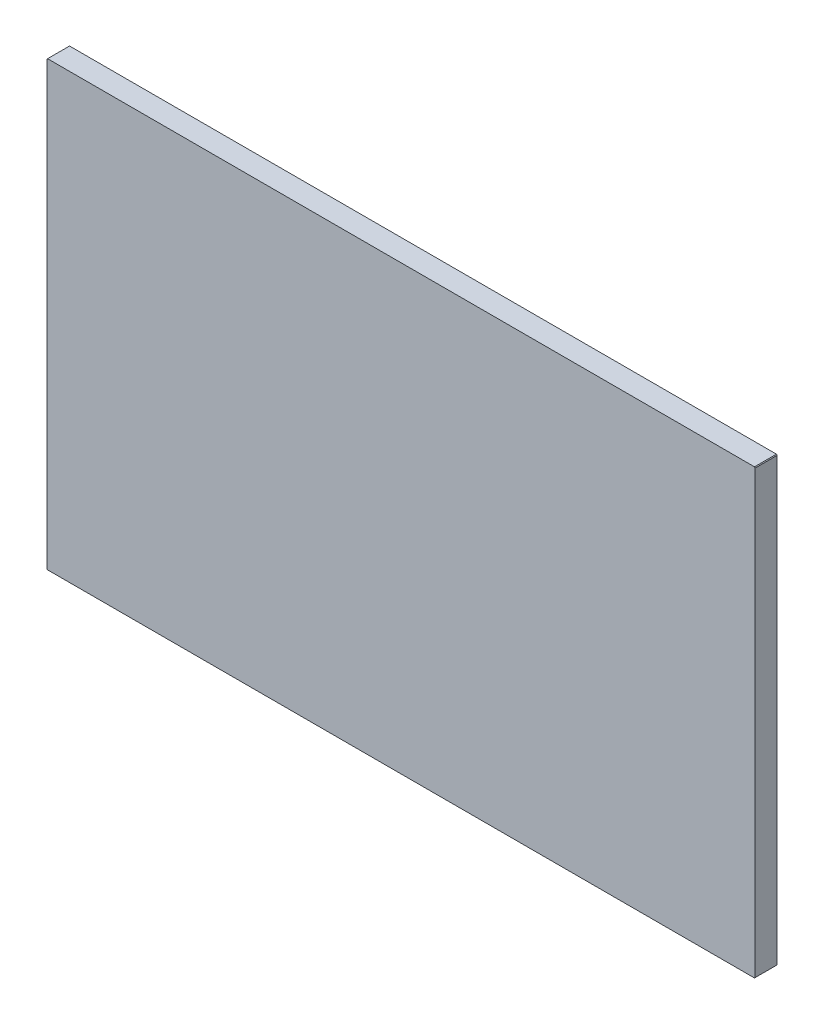
ISO-10303-21;
HEADER;
FILE_DESCRIPTION(('STEP AP214'),'2;1');
FILE_NAME('part.step','',(''),(''),'','','');
FILE_SCHEMA(('AUTOMOTIVE_DESIGN { 1 0 10303 214 1 1 1 1 }'));
ENDSEC;
DATA;
#1=APPLICATION_CONTEXT('core data for automotive mechanical design processes');
#2=APPLICATION_PROTOCOL_DEFINITION('international standard','automotive_design',2000,#1);
#3=PRODUCT_CONTEXT('',#1,'mechanical');
#4=PRODUCT('Part','Part','',(#3));
#5=PRODUCT_RELATED_PRODUCT_CATEGORY('part','',(#4));
#6=PRODUCT_DEFINITION_FORMATION('','',#4);
#7=PRODUCT_DEFINITION_CONTEXT('part definition',#1,'design');
#8=PRODUCT_DEFINITION('design','',#6,#7);
#9=PRODUCT_DEFINITION_SHAPE('','',#8);
#10=(LENGTH_UNIT() NAMED_UNIT(*) SI_UNIT(.MILLI.,.METRE.));
#11=(NAMED_UNIT(*) PLANE_ANGLE_UNIT() SI_UNIT($,.RADIAN.));
#12=(NAMED_UNIT(*) SI_UNIT($,.STERADIAN.) SOLID_ANGLE_UNIT());
#13=UNCERTAINTY_MEASURE_WITH_UNIT(LENGTH_MEASURE(1.E-05),#10,'distance_accuracy_value','');
#14=(GEOMETRIC_REPRESENTATION_CONTEXT(3) GLOBAL_UNCERTAINTY_ASSIGNED_CONTEXT((#13)) GLOBAL_UNIT_ASSIGNED_CONTEXT((#10,
#11,#12)) REPRESENTATION_CONTEXT('',''));
#15=CARTESIAN_POINT('',(0.,0.,0.));
#16=DIRECTION('',(0.,0.,1.));
#17=DIRECTION('',(1.,0.,0.));
#18=AXIS2_PLACEMENT_3D('',#15,#16,#17);
#19=CARTESIAN_POINT('',(-0.0254,15.875,0.7874));
#20=DIRECTION('',(0.,-1.,0.));
#21=DIRECTION('',(1.,0.,0.));
#22=AXIS2_PLACEMENT_3D('',#19,#20,#21);
#23=PLANE('',#22);
#24=DIRECTION('',(-1.,0.,0.));
#25=VECTOR('',#24,1.);
#26=CARTESIAN_POINT('',(-0.0254,15.875,0.));
#27=LINE('',#26,#25);
#28=CARTESIAN_POINT('',(-0.0254,15.875,0.));
#29=VERTEX_POINT('',#28);
#30=CARTESIAN_POINT('',(-25.3746,15.875,0.));
#31=VERTEX_POINT('',#30);
#32=EDGE_CURVE('E129',#29,#31,#27,.T.);
#33=ORIENTED_EDGE('',*,*,#32,.T.);
#34=DIRECTION('',(0.,0.,-1.));
#35=VECTOR('',#34,1.);
#36=CARTESIAN_POINT('',(-25.3746,15.875,0.7874));
#37=LINE('',#36,#35);
#38=CARTESIAN_POINT('',(-25.3746,15.875,0.7874));
#39=VERTEX_POINT('',#38);
#40=EDGE_CURVE('E11',#39,#31,#37,.T.);
#41=ORIENTED_EDGE('',*,*,#40,.F.);
#42=DIRECTION('',(-1.,0.,0.));
#43=VECTOR('',#42,1.);
#44=CARTESIAN_POINT('',(-0.0254,15.875,0.7874));
#45=LINE('',#44,#43);
#46=CARTESIAN_POINT('',(-0.0254,15.875,0.7874));
#47=VERTEX_POINT('',#46);
#48=EDGE_CURVE('E143',#47,#39,#45,.T.);
#49=ORIENTED_EDGE('',*,*,#48,.F.);
#50=DIRECTION('',(0.,0.,-1.));
#51=VECTOR('',#50,1.);
#52=CARTESIAN_POINT('',(-0.0254,15.875,0.7874));
#53=LINE('',#52,#51);
#54=EDGE_CURVE('E125',#47,#29,#53,.T.);
#55=ORIENTED_EDGE('',*,*,#54,.T.);
#56=EDGE_LOOP('',(#33,#41,#49,#55));
#57=FACE_BOUND('',#56,.T.);
#58=ADVANCED_FACE('F33',(#57),#23,.F.);
#59=CARTESIAN_POINT('',(-25.3746,15.875,0.7874));
#60=DIRECTION('',(0.707106781186499,-0.707106781186596,0.));
#61=DIRECTION('',(0.707106781186596,0.707106781186499,0.));
#62=AXIS2_PLACEMENT_3D('',#59,#60,#61);
#63=PLANE('',#62);
#64=DIRECTION('',(-0.707106781186596,-0.707106781186499,0.));
#65=VECTOR('',#64,1.);
#66=CARTESIAN_POINT('',(-25.3746,15.875,0.));
#67=LINE('',#66,#65);
#68=CARTESIAN_POINT('',(-25.4,15.8496,0.));
#69=VERTEX_POINT('',#68);
#70=EDGE_CURVE('E132',#31,#69,#67,.T.);
#71=ORIENTED_EDGE('',*,*,#70,.T.);
#72=DIRECTION('',(0.,0.,-1.));
#73=VECTOR('',#72,1.);
#74=CARTESIAN_POINT('',(-25.4,15.8496,0.7874));
#75=LINE('',#74,#73);
#76=CARTESIAN_POINT('',(-25.4,15.8496,0.7874));
#77=VERTEX_POINT('',#76);
#78=EDGE_CURVE('E41',#77,#69,#75,.T.);
#79=ORIENTED_EDGE('',*,*,#78,.F.);
#80=DIRECTION('',(-0.707106781186596,-0.707106781186499,0.));
#81=VECTOR('',#80,1.);
#82=CARTESIAN_POINT('',(-25.3746,15.875,0.7874));
#83=LINE('',#82,#81);
#84=EDGE_CURVE('E92',#39,#77,#83,.T.);
#85=ORIENTED_EDGE('',*,*,#84,.F.);
#86=ORIENTED_EDGE('',*,*,#40,.T.);
#87=EDGE_LOOP('',(#71,#79,#85,#86));
#88=FACE_BOUND('',#87,.T.);
#89=ADVANCED_FACE('F178',(#88),#63,.F.);
#90=CARTESIAN_POINT('',(-25.4,0.0253999999999954,0.7874));
#91=DIRECTION('',(1.,0.,0.));
#92=DIRECTION('',(0.,0.,-1.));
#93=AXIS2_PLACEMENT_3D('',#90,#91,#92);
#94=PLANE('',#93);
#95=DIRECTION('',(0.,-1.,0.));
#96=VECTOR('',#95,1.);
#97=CARTESIAN_POINT('',(-25.4,0.0253999999999954,0.));
#98=LINE('',#97,#96);
#99=CARTESIAN_POINT('',(-25.4,0.0253999999999954,0.));
#100=VERTEX_POINT('',#99);
#101=EDGE_CURVE('E134',#69,#100,#98,.T.);
#102=ORIENTED_EDGE('',*,*,#101,.T.);
#103=DIRECTION('',(0.,0.,-1.));
#104=VECTOR('',#103,1.);
#105=CARTESIAN_POINT('',(-25.4,0.0253999999999954,0.7874));
#106=LINE('',#105,#104);
#107=CARTESIAN_POINT('',(-25.4,0.0253999999999954,0.7874));
#108=VERTEX_POINT('',#107);
#109=EDGE_CURVE('E150',#108,#100,#106,.T.);
#110=ORIENTED_EDGE('',*,*,#109,.F.);
#111=DIRECTION('',(0.,-1.,0.));
#112=VECTOR('',#111,1.);
#113=CARTESIAN_POINT('',(-25.4,0.0253999999999954,0.7874));
#114=LINE('',#113,#112);
#115=EDGE_CURVE('E158',#77,#108,#114,.T.);
#116=ORIENTED_EDGE('',*,*,#115,.F.);
#117=ORIENTED_EDGE('',*,*,#78,.T.);
#118=EDGE_LOOP('',(#102,#110,#116,#117));
#119=FACE_BOUND('',#118,.T.);
#120=ADVANCED_FACE('F156',(#119),#94,.F.);
#121=CARTESIAN_POINT('',(-25.3746,0.,0.7874));
#122=DIRECTION('',(0.707106781186549,0.707106781186546,0.));
#123=DIRECTION('',(-0.707106781186546,0.707106781186549,0.));
#124=AXIS2_PLACEMENT_3D('',#121,#122,#123);
#125=PLANE('',#124);
#126=DIRECTION('',(0.707106781186546,-0.707106781186549,0.));
#127=VECTOR('',#126,1.);
#128=CARTESIAN_POINT('',(-25.3746,0.,0.));
#129=LINE('',#128,#127);
#130=CARTESIAN_POINT('',(-25.3746,0.,0.));
#131=VERTEX_POINT('',#130);
#132=EDGE_CURVE('E136',#100,#131,#129,.T.);
#133=ORIENTED_EDGE('',*,*,#132,.T.);
#134=DIRECTION('',(0.,0.,-1.));
#135=VECTOR('',#134,1.);
#136=CARTESIAN_POINT('',(-25.3746,0.,0.7874));
#137=LINE('',#136,#135);
#138=CARTESIAN_POINT('',(-25.3746,0.,0.7874));
#139=VERTEX_POINT('',#138);
#140=EDGE_CURVE('E147',#139,#131,#137,.T.);
#141=ORIENTED_EDGE('',*,*,#140,.F.);
#142=DIRECTION('',(0.707106781186546,-0.707106781186549,0.));
#143=VECTOR('',#142,1.);
#144=CARTESIAN_POINT('',(-25.3746,0.,0.7874));
#145=LINE('',#144,#143);
#146=EDGE_CURVE('E170',#108,#139,#145,.T.);
#147=ORIENTED_EDGE('',*,*,#146,.F.);
#148=ORIENTED_EDGE('',*,*,#109,.T.);
#149=EDGE_LOOP('',(#133,#141,#147,#148));
#150=FACE_BOUND('',#149,.T.);
#151=ADVANCED_FACE('F166',(#150),#125,.F.);
#152=CARTESIAN_POINT('',(-0.0254,0.,0.7874));
#153=DIRECTION('',(0.,1.,0.));
#154=DIRECTION('',(-1.,0.,0.));
#155=AXIS2_PLACEMENT_3D('',#152,#153,#154);
#156=PLANE('',#155);
#157=DIRECTION('',(1.,0.,0.));
#158=VECTOR('',#157,1.);
#159=CARTESIAN_POINT('',(-0.0254,0.,0.));
#160=LINE('',#159,#158);
#161=CARTESIAN_POINT('',(-0.0254,0.,0.));
#162=VERTEX_POINT('',#161);
#163=EDGE_CURVE('E138',#131,#162,#160,.T.);
#164=ORIENTED_EDGE('',*,*,#163,.T.);
#165=DIRECTION('',(0.,0.,-1.));
#166=VECTOR('',#165,1.);
#167=CARTESIAN_POINT('',(-0.0254,0.,0.7874));
#168=LINE('',#167,#166);
#169=CARTESIAN_POINT('',(-0.0254,0.,0.7874));
#170=VERTEX_POINT('',#169);
#171=EDGE_CURVE('E120',#170,#162,#168,.T.);
#172=ORIENTED_EDGE('',*,*,#171,.F.);
#173=DIRECTION('',(1.,0.,0.));
#174=VECTOR('',#173,1.);
#175=CARTESIAN_POINT('',(-0.0254,0.,0.7874));
#176=LINE('',#175,#174);
#177=EDGE_CURVE('E111',#139,#170,#176,.T.);
#178=ORIENTED_EDGE('',*,*,#177,.F.);
#179=ORIENTED_EDGE('',*,*,#140,.T.);
#180=EDGE_LOOP('',(#164,#172,#178,#179));
#181=FACE_BOUND('',#180,.T.);
#182=ADVANCED_FACE('F169',(#181),#156,.F.);
#183=CARTESIAN_POINT('',(0.,0.0254,0.7874));
#184=DIRECTION('',(-0.707106781186546,0.707106781186549,0.));
#185=DIRECTION('',(-0.707106781186549,-0.707106781186546,0.));
#186=AXIS2_PLACEMENT_3D('',#183,#184,#185);
#187=PLANE('',#186);
#188=DIRECTION('',(0.707106781186549,0.707106781186546,0.));
#189=VECTOR('',#188,1.);
#190=CARTESIAN_POINT('',(0.,0.0254,0.));
#191=LINE('',#190,#189);
#192=CARTESIAN_POINT('',(0.,0.0254,0.));
#193=VERTEX_POINT('',#192);
#194=EDGE_CURVE('E119',#162,#193,#191,.T.);
#195=ORIENTED_EDGE('',*,*,#194,.T.);
#196=DIRECTION('',(0.,0.,-1.));
#197=VECTOR('',#196,1.);
#198=CARTESIAN_POINT('',(0.,0.0254,0.7874));
#199=LINE('',#198,#197);
#200=CARTESIAN_POINT('',(0.,0.0254,0.7874));
#201=VERTEX_POINT('',#200);
#202=EDGE_CURVE('E116',#201,#193,#199,.T.);
#203=ORIENTED_EDGE('',*,*,#202,.F.);
#204=DIRECTION('',(0.707106781186549,0.707106781186546,0.));
#205=VECTOR('',#204,1.);
#206=CARTESIAN_POINT('',(0.,0.0254,0.7874));
#207=LINE('',#206,#205);
#208=EDGE_CURVE('E105',#170,#201,#207,.T.);
#209=ORIENTED_EDGE('',*,*,#208,.F.);
#210=ORIENTED_EDGE('',*,*,#171,.T.);
#211=EDGE_LOOP('',(#195,#203,#209,#210));
#212=FACE_BOUND('',#211,.T.);
#213=ADVANCED_FACE('F117',(#212),#187,.F.);
#214=CARTESIAN_POINT('',(0.,0.0254,0.7874));
#215=DIRECTION('',(-1.,0.,0.));
#216=DIRECTION('',(0.,0.,1.));
#217=AXIS2_PLACEMENT_3D('',#214,#215,#216);
#218=PLANE('',#217);
#219=DIRECTION('',(0.,1.,0.));
#220=VECTOR('',#219,1.);
#221=CARTESIAN_POINT('',(0.,0.0254,0.));
#222=LINE('',#221,#220);
#223=CARTESIAN_POINT('',(0.,15.8496,0.));
#224=VERTEX_POINT('',#223);
#225=EDGE_CURVE('E78',#193,#224,#222,.T.);
#226=ORIENTED_EDGE('',*,*,#225,.T.);
#227=DIRECTION('',(0.,0.,-1.));
#228=VECTOR('',#227,1.);
#229=CARTESIAN_POINT('',(0.,15.8496,0.7874));
#230=LINE('',#229,#228);
#231=CARTESIAN_POINT('',(0.,15.8496,0.7874));
#232=VERTEX_POINT('',#231);
#233=EDGE_CURVE('E121',#232,#224,#230,.T.);
#234=ORIENTED_EDGE('',*,*,#233,.F.);
#235=DIRECTION('',(0.,1.,0.));
#236=VECTOR('',#235,1.);
#237=CARTESIAN_POINT('',(0.,0.0254,0.7874));
#238=LINE('',#237,#236);
#239=EDGE_CURVE('E109',#201,#232,#238,.T.);
#240=ORIENTED_EDGE('',*,*,#239,.F.);
#241=ORIENTED_EDGE('',*,*,#202,.T.);
#242=EDGE_LOOP('',(#226,#234,#240,#241));
#243=FACE_BOUND('',#242,.T.);
#244=ADVANCED_FACE('F123',(#243),#218,.F.);
#245=CARTESIAN_POINT('',(0.,15.8496,0.7874));
#246=DIRECTION('',(-0.707106781186525,-0.70710678118657,0.));
#247=DIRECTION('',(0.70710678118657,-0.707106781186525,0.));
#248=AXIS2_PLACEMENT_3D('',#245,#246,#247);
#249=PLANE('',#248);
#250=DIRECTION('',(-0.70710678118657,0.707106781186525,0.));
#251=VECTOR('',#250,1.);
#252=CARTESIAN_POINT('',(0.,15.8496,0.));
#253=LINE('',#252,#251);
#254=EDGE_CURVE('E84',#224,#29,#253,.T.);
#255=ORIENTED_EDGE('',*,*,#254,.T.);
#256=ORIENTED_EDGE('',*,*,#54,.F.);
#257=DIRECTION('',(-0.70710678118657,0.707106781186525,0.));
#258=VECTOR('',#257,1.);
#259=CARTESIAN_POINT('',(0.,15.8496,0.7874));
#260=LINE('',#259,#258);
#261=EDGE_CURVE('E49',#232,#47,#260,.T.);
#262=ORIENTED_EDGE('',*,*,#261,.F.);
#263=ORIENTED_EDGE('',*,*,#233,.T.);
#264=EDGE_LOOP('',(#255,#256,#262,#263));
#265=FACE_BOUND('',#264,.T.);
#266=ADVANCED_FACE('F194',(#265),#249,.F.);
#267=CARTESIAN_POINT('',(-25.4,15.875,0.7874));
#268=DIRECTION('',(0.,0.,-1.));
#269=DIRECTION('',(-1.,0.,0.));
#270=AXIS2_PLACEMENT_3D('',#267,#268,#269);
#271=PLANE('',#270);
#272=ORIENTED_EDGE('',*,*,#48,.T.);
#273=ORIENTED_EDGE('',*,*,#84,.T.);
#274=ORIENTED_EDGE('',*,*,#115,.T.);
#275=ORIENTED_EDGE('',*,*,#146,.T.);
#276=ORIENTED_EDGE('',*,*,#177,.T.);
#277=ORIENTED_EDGE('',*,*,#208,.T.);
#278=ORIENTED_EDGE('',*,*,#239,.T.);
#279=ORIENTED_EDGE('',*,*,#261,.T.);
#280=EDGE_LOOP('',(#272,#273,#274,#275,#276,#277,#278,#279));
#281=FACE_BOUND('',#280,.T.);
#282=ADVANCED_FACE('F107',(#281),#271,.F.);
#283=CARTESIAN_POINT('',(-25.4,15.875,0.));
#284=DIRECTION('',(0.,0.,-1.));
#285=DIRECTION('',(-1.,0.,0.));
#286=AXIS2_PLACEMENT_3D('',#283,#284,#285);
#287=PLANE('',#286);
#288=ORIENTED_EDGE('',*,*,#32,.F.);
#289=ORIENTED_EDGE('',*,*,#254,.F.);
#290=ORIENTED_EDGE('',*,*,#225,.F.);
#291=ORIENTED_EDGE('',*,*,#194,.F.);
#292=ORIENTED_EDGE('',*,*,#163,.F.);
#293=ORIENTED_EDGE('',*,*,#132,.F.);
#294=ORIENTED_EDGE('',*,*,#101,.F.);
#295=ORIENTED_EDGE('',*,*,#70,.F.);
#296=EDGE_LOOP('',(#288,#289,#290,#291,#292,#293,#294,#295));
#297=FACE_BOUND('',#296,.T.);
#298=ADVANCED_FACE('F162',(#297),#287,.T.);
#299=CLOSED_SHELL('',(#58,#89,#120,#151,#182,#213,#244,#266,#282,#298));
#300=MANIFOLD_SOLID_BREP('B2',#299);
#301=ADVANCED_BREP_SHAPE_REPRESENTATION('',(#18,#300),#14);
#302=SHAPE_DEFINITION_REPRESENTATION(#9,#301);
ENDSEC;
END-ISO-10303-21;
